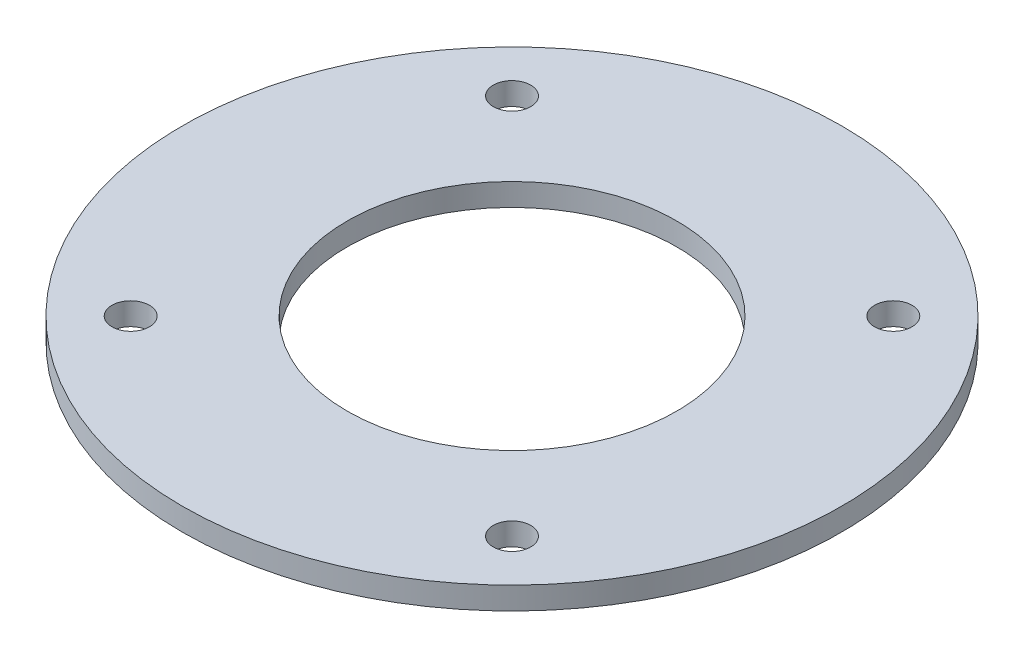
ISO-10303-21;
HEADER;
FILE_DESCRIPTION(('STEP AP214'),'2;1');
FILE_NAME('part.step','',(''),(''),'','','');
FILE_SCHEMA(('AUTOMOTIVE_DESIGN { 1 0 10303 214 1 1 1 1 }'));
ENDSEC;
DATA;
#1=APPLICATION_CONTEXT('core data for automotive mechanical design processes');
#2=APPLICATION_PROTOCOL_DEFINITION('international standard','automotive_design',2000,#1);
#3=PRODUCT_CONTEXT('',#1,'mechanical');
#4=PRODUCT('Part','Part','',(#3));
#5=PRODUCT_RELATED_PRODUCT_CATEGORY('part','',(#4));
#6=PRODUCT_DEFINITION_FORMATION('','',#4);
#7=PRODUCT_DEFINITION_CONTEXT('part definition',#1,'design');
#8=PRODUCT_DEFINITION('design','',#6,#7);
#9=PRODUCT_DEFINITION_SHAPE('','',#8);
#10=(LENGTH_UNIT() NAMED_UNIT(*) SI_UNIT(.MILLI.,.METRE.));
#11=(NAMED_UNIT(*) PLANE_ANGLE_UNIT() SI_UNIT($,.RADIAN.));
#12=(NAMED_UNIT(*) SI_UNIT($,.STERADIAN.) SOLID_ANGLE_UNIT());
#13=UNCERTAINTY_MEASURE_WITH_UNIT(LENGTH_MEASURE(1.E-05),#10,'distance_accuracy_value','');
#14=(GEOMETRIC_REPRESENTATION_CONTEXT(3) GLOBAL_UNCERTAINTY_ASSIGNED_CONTEXT((#13)) GLOBAL_UNIT_ASSIGNED_CONTEXT((#10,
#11,#12)) REPRESENTATION_CONTEXT('',''));
#15=CARTESIAN_POINT('',(0.,0.,0.));
#16=DIRECTION('',(0.,0.,1.));
#17=DIRECTION('',(1.,0.,0.));
#18=AXIS2_PLACEMENT_3D('',#15,#16,#17);
#19=CARTESIAN_POINT('',(-50.7491797188427,9.525,-92.6521317375132));
#20=DIRECTION('',(0.,1.,0.));
#21=DIRECTION('',(0.,0.,1.));
#22=AXIS2_PLACEMENT_3D('',#19,#20,#21);
#23=PLANE('',#22);
#24=CARTESIAN_POINT('',(30.0731253707797,9.525,-11.8298266478908));
#25=DIRECTION('',(0.,1.,0.));
#26=DIRECTION('',(0.,0.,1.));
#27=AXIS2_PLACEMENT_3D('',#24,#25,#26);
#28=CIRCLE('',#27,7.9375);
#29=CARTESIAN_POINT('',(30.0731253707797,9.525,-3.8923266478908));
#30=VERTEX_POINT('',#29);
#31=EDGE_CURVE('E74',#30,#30,#28,.T.);
#32=ORIENTED_EDGE('',*,*,#31,.F.);
#33=EDGE_LOOP('',(#32));
#34=FACE_BOUND('',#33,.T.);
#35=CARTESIAN_POINT('',(-131.571484808465,9.525,-173.474436827136));
#36=DIRECTION('',(0.,1.,0.));
#37=DIRECTION('',(0.,0.,1.));
#38=AXIS2_PLACEMENT_3D('',#35,#36,#37);
#39=CIRCLE('',#38,7.93749999999999);
#40=CARTESIAN_POINT('',(-131.571484808465,9.525,-165.536936827136));
#41=VERTEX_POINT('',#40);
#42=EDGE_CURVE('E58',#41,#41,#39,.T.);
#43=ORIENTED_EDGE('',*,*,#42,.F.);
#44=EDGE_LOOP('',(#43));
#45=FACE_BOUND('',#44,.T.);
#46=CARTESIAN_POINT('',(-50.7491797188427,9.525,-92.6521317375132));
#47=DIRECTION('',(0.,1.,0.));
#48=DIRECTION('',(0.,0.,1.));
#49=AXIS2_PLACEMENT_3D('',#46,#47,#48);
#50=CIRCLE('',#49,139.7);
#51=CARTESIAN_POINT('',(-50.7491797188427,9.525,47.0478682624868));
#52=VERTEX_POINT('',#51);
#53=EDGE_CURVE('E10',#52,#52,#50,.T.);
#54=ORIENTED_EDGE('',*,*,#53,.T.);
#55=EDGE_LOOP('',(#54));
#56=FACE_BOUND('',#55,.T.);
#57=CARTESIAN_POINT('',(-50.7491797188427,9.525,-92.6521317375132));
#58=DIRECTION('',(0.,1.,0.));
#59=DIRECTION('',(0.,0.,1.));
#60=AXIS2_PLACEMENT_3D('',#57,#58,#59);
#61=CIRCLE('',#60,69.85);
#62=CARTESIAN_POINT('',(-50.7491797188427,9.525,-22.8021317375132));
#63=VERTEX_POINT('',#62);
#64=EDGE_CURVE('E52',#63,#63,#61,.T.);
#65=ORIENTED_EDGE('',*,*,#64,.F.);
#66=EDGE_LOOP('',(#65));
#67=FACE_BOUND('',#66,.T.);
#68=CARTESIAN_POINT('',(-131.571484808465,9.525,-11.8298266478908));
#69=DIRECTION('',(0.,1.,0.));
#70=DIRECTION('',(0.,0.,1.));
#71=AXIS2_PLACEMENT_3D('',#68,#69,#70);
#72=CIRCLE('',#71,7.93749999999999);
#73=CARTESIAN_POINT('',(-131.571484808465,9.525,-3.89232664789078));
#74=VERTEX_POINT('',#73);
#75=EDGE_CURVE('E66',#74,#74,#72,.T.);
#76=ORIENTED_EDGE('',*,*,#75,.F.);
#77=EDGE_LOOP('',(#76));
#78=FACE_BOUND('',#77,.T.);
#79=CARTESIAN_POINT('',(30.0731253707797,9.525,-173.474436827136));
#80=DIRECTION('',(0.,1.,0.));
#81=DIRECTION('',(0.,0.,1.));
#82=AXIS2_PLACEMENT_3D('',#79,#80,#81);
#83=CIRCLE('',#82,7.9375);
#84=CARTESIAN_POINT('',(30.0731253707797,9.525,-165.536936827136));
#85=VERTEX_POINT('',#84);
#86=EDGE_CURVE('E82',#85,#85,#83,.T.);
#87=ORIENTED_EDGE('',*,*,#86,.F.);
#88=EDGE_LOOP('',(#87));
#89=FACE_BOUND('',#88,.T.);
#90=ADVANCED_FACE('F39',(#34,#45,#56,#67,#78,#89),#23,.T.);
#91=CARTESIAN_POINT('',(-50.7491797188427,0.,-92.6521317375132));
#92=DIRECTION('',(0.,1.,0.));
#93=DIRECTION('',(0.,0.,1.));
#94=AXIS2_PLACEMENT_3D('',#91,#92,#93);
#95=PLANE('',#94);
#96=CARTESIAN_POINT('',(-50.7491797188427,0.,-92.6521317375132));
#97=DIRECTION('',(0.,1.,0.));
#98=DIRECTION('',(0.,0.,1.));
#99=AXIS2_PLACEMENT_3D('',#96,#97,#98);
#100=CIRCLE('',#99,139.7);
#101=CARTESIAN_POINT('',(-50.7491797188427,0.,47.0478682624868));
#102=VERTEX_POINT('',#101);
#103=EDGE_CURVE('E43',#102,#102,#100,.T.);
#104=ORIENTED_EDGE('',*,*,#103,.F.);
#105=EDGE_LOOP('',(#104));
#106=FACE_BOUND('',#105,.T.);
#107=CARTESIAN_POINT('',(-50.7491797188427,0.,-92.6521317375132));
#108=DIRECTION('',(0.,1.,0.));
#109=DIRECTION('',(0.,0.,1.));
#110=AXIS2_PLACEMENT_3D('',#107,#108,#109);
#111=CIRCLE('',#110,69.85);
#112=CARTESIAN_POINT('',(-50.7491797188427,0.,-22.8021317375132));
#113=VERTEX_POINT('',#112);
#114=EDGE_CURVE('E54',#113,#113,#111,.T.);
#115=ORIENTED_EDGE('',*,*,#114,.T.);
#116=EDGE_LOOP('',(#115));
#117=FACE_BOUND('',#116,.T.);
#118=CARTESIAN_POINT('',(-131.571484808465,0.,-173.474436827136));
#119=DIRECTION('',(0.,1.,0.));
#120=DIRECTION('',(0.,0.,1.));
#121=AXIS2_PLACEMENT_3D('',#118,#119,#120);
#122=CIRCLE('',#121,7.93749999999999);
#123=CARTESIAN_POINT('',(-131.571484808465,0.,-165.536936827136));
#124=VERTEX_POINT('',#123);
#125=EDGE_CURVE('E62',#124,#124,#122,.T.);
#126=ORIENTED_EDGE('',*,*,#125,.T.);
#127=EDGE_LOOP('',(#126));
#128=FACE_BOUND('',#127,.T.);
#129=CARTESIAN_POINT('',(-131.571484808465,0.,-11.8298266478908));
#130=DIRECTION('',(0.,1.,0.));
#131=DIRECTION('',(0.,0.,1.));
#132=AXIS2_PLACEMENT_3D('',#129,#130,#131);
#133=CIRCLE('',#132,7.93749999999999);
#134=CARTESIAN_POINT('',(-131.571484808465,0.,-3.89232664789078));
#135=VERTEX_POINT('',#134);
#136=EDGE_CURVE('E70',#135,#135,#133,.T.);
#137=ORIENTED_EDGE('',*,*,#136,.T.);
#138=EDGE_LOOP('',(#137));
#139=FACE_BOUND('',#138,.T.);
#140=CARTESIAN_POINT('',(30.0731253707797,0.,-11.8298266478908));
#141=DIRECTION('',(0.,1.,0.));
#142=DIRECTION('',(0.,0.,1.));
#143=AXIS2_PLACEMENT_3D('',#140,#141,#142);
#144=CIRCLE('',#143,7.9375);
#145=CARTESIAN_POINT('',(30.0731253707797,0.,-3.8923266478908));
#146=VERTEX_POINT('',#145);
#147=EDGE_CURVE('E78',#146,#146,#144,.T.);
#148=ORIENTED_EDGE('',*,*,#147,.T.);
#149=EDGE_LOOP('',(#148));
#150=FACE_BOUND('',#149,.T.);
#151=CARTESIAN_POINT('',(30.0731253707797,0.,-173.474436827136));
#152=DIRECTION('',(0.,1.,0.));
#153=DIRECTION('',(0.,0.,1.));
#154=AXIS2_PLACEMENT_3D('',#151,#152,#153);
#155=CIRCLE('',#154,7.9375);
#156=CARTESIAN_POINT('',(30.0731253707797,0.,-165.536936827136));
#157=VERTEX_POINT('',#156);
#158=EDGE_CURVE('E86',#157,#157,#155,.T.);
#159=ORIENTED_EDGE('',*,*,#158,.T.);
#160=EDGE_LOOP('',(#159));
#161=FACE_BOUND('',#160,.T.);
#162=ADVANCED_FACE('F98',(#106,#117,#128,#139,#150,#161),#95,.F.);
#163=CARTESIAN_POINT('',(-50.7491797188427,9.525,-92.6521317375132));
#164=DIRECTION('',(0.,-1.,0.));
#165=DIRECTION('',(0.,0.,-1.));
#166=AXIS2_PLACEMENT_3D('',#163,#164,#165);
#167=CYLINDRICAL_SURFACE('',#166,139.7);
#168=ORIENTED_EDGE('',*,*,#53,.F.);
#169=EDGE_LOOP('',(#168));
#170=FACE_BOUND('',#169,.T.);
#171=ORIENTED_EDGE('',*,*,#103,.T.);
#172=EDGE_LOOP('',(#171));
#173=FACE_BOUND('',#172,.T.);
#174=ADVANCED_FACE('F41',(#170,#173),#167,.T.);
#175=CARTESIAN_POINT('',(-50.7491797188427,9.525,-92.6521317375132));
#176=DIRECTION('',(0.,-1.,0.));
#177=DIRECTION('',(0.,0.,-1.));
#178=AXIS2_PLACEMENT_3D('',#175,#176,#177);
#179=CYLINDRICAL_SURFACE('',#178,69.85);
#180=ORIENTED_EDGE('',*,*,#64,.T.);
#181=EDGE_LOOP('',(#180));
#182=FACE_BOUND('',#181,.T.);
#183=ORIENTED_EDGE('',*,*,#114,.F.);
#184=EDGE_LOOP('',(#183));
#185=FACE_BOUND('',#184,.T.);
#186=ADVANCED_FACE('F108',(#182,#185),#179,.F.);
#187=CARTESIAN_POINT('',(-131.571484808465,9.525,-173.474436827136));
#188=DIRECTION('',(0.,-1.,0.));
#189=DIRECTION('',(0.,0.,-1.));
#190=AXIS2_PLACEMENT_3D('',#187,#188,#189);
#191=CYLINDRICAL_SURFACE('',#190,7.93749999999999);
#192=ORIENTED_EDGE('',*,*,#42,.T.);
#193=EDGE_LOOP('',(#192));
#194=FACE_BOUND('',#193,.T.);
#195=ORIENTED_EDGE('',*,*,#125,.F.);
#196=EDGE_LOOP('',(#195));
#197=FACE_BOUND('',#196,.T.);
#198=ADVANCED_FACE('F111',(#194,#197),#191,.F.);
#199=CARTESIAN_POINT('',(-131.571484808465,9.525,-11.8298266478908));
#200=DIRECTION('',(0.,-1.,0.));
#201=DIRECTION('',(0.,0.,-1.));
#202=AXIS2_PLACEMENT_3D('',#199,#200,#201);
#203=CYLINDRICAL_SURFACE('',#202,7.93749999999999);
#204=ORIENTED_EDGE('',*,*,#75,.T.);
#205=EDGE_LOOP('',(#204));
#206=FACE_BOUND('',#205,.T.);
#207=ORIENTED_EDGE('',*,*,#136,.F.);
#208=EDGE_LOOP('',(#207));
#209=FACE_BOUND('',#208,.T.);
#210=ADVANCED_FACE('F115',(#206,#209),#203,.F.);
#211=CARTESIAN_POINT('',(30.0731253707797,9.525,-11.8298266478908));
#212=DIRECTION('',(0.,-1.,0.));
#213=DIRECTION('',(0.,0.,-1.));
#214=AXIS2_PLACEMENT_3D('',#211,#212,#213);
#215=CYLINDRICAL_SURFACE('',#214,7.9375);
#216=ORIENTED_EDGE('',*,*,#31,.T.);
#217=EDGE_LOOP('',(#216));
#218=FACE_BOUND('',#217,.T.);
#219=ORIENTED_EDGE('',*,*,#147,.F.);
#220=EDGE_LOOP('',(#219));
#221=FACE_BOUND('',#220,.T.);
#222=ADVANCED_FACE('F119',(#218,#221),#215,.F.);
#223=CARTESIAN_POINT('',(30.0731253707797,9.525,-173.474436827136));
#224=DIRECTION('',(0.,-1.,0.));
#225=DIRECTION('',(0.,0.,-1.));
#226=AXIS2_PLACEMENT_3D('',#223,#224,#225);
#227=CYLINDRICAL_SURFACE('',#226,7.9375);
#228=ORIENTED_EDGE('',*,*,#86,.T.);
#229=EDGE_LOOP('',(#228));
#230=FACE_BOUND('',#229,.T.);
#231=ORIENTED_EDGE('',*,*,#158,.F.);
#232=EDGE_LOOP('',(#231));
#233=FACE_BOUND('',#232,.T.);
#234=ADVANCED_FACE('F94',(#230,#233),#227,.F.);
#235=CLOSED_SHELL('',(#90,#162,#174,#186,#198,#210,#222,#234));
#236=MANIFOLD_SOLID_BREP('B2',#235);
#237=ADVANCED_BREP_SHAPE_REPRESENTATION('',(#18,#236),#14);
#238=SHAPE_DEFINITION_REPRESENTATION(#9,#237);
ENDSEC;
END-ISO-10303-21;
